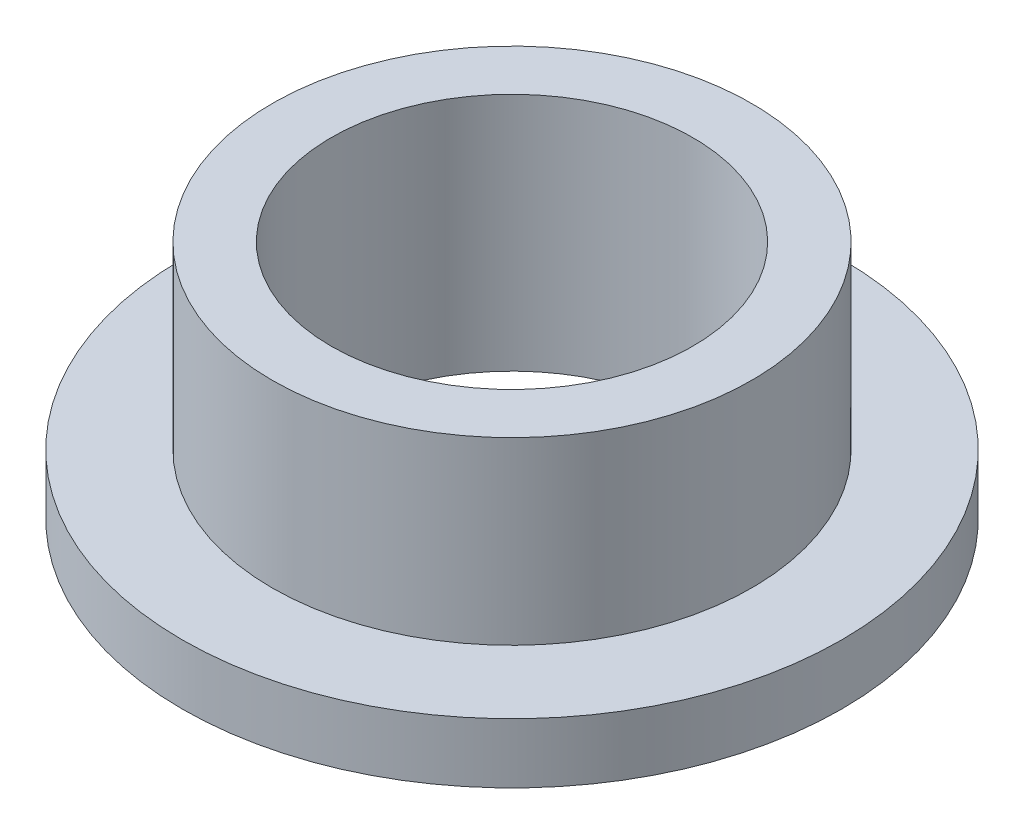
ISO-10303-21;
HEADER;
FILE_DESCRIPTION(('STEP AP214'),'2;1');
FILE_NAME('part.step','',(''),(''),'','','');
FILE_SCHEMA(('AUTOMOTIVE_DESIGN { 1 0 10303 214 1 1 1 1 }'));
ENDSEC;
DATA;
#1=APPLICATION_CONTEXT('core data for automotive mechanical design processes');
#2=APPLICATION_PROTOCOL_DEFINITION('international standard','automotive_design',2000,#1);
#3=PRODUCT_CONTEXT('',#1,'mechanical');
#4=PRODUCT('Part','Part','',(#3));
#5=PRODUCT_RELATED_PRODUCT_CATEGORY('part','',(#4));
#6=PRODUCT_DEFINITION_FORMATION('','',#4);
#7=PRODUCT_DEFINITION_CONTEXT('part definition',#1,'design');
#8=PRODUCT_DEFINITION('design','',#6,#7);
#9=PRODUCT_DEFINITION_SHAPE('','',#8);
#10=(LENGTH_UNIT() NAMED_UNIT(*) SI_UNIT(.MILLI.,.METRE.));
#11=(NAMED_UNIT(*) PLANE_ANGLE_UNIT() SI_UNIT($,.RADIAN.));
#12=(NAMED_UNIT(*) SI_UNIT($,.STERADIAN.) SOLID_ANGLE_UNIT());
#13=UNCERTAINTY_MEASURE_WITH_UNIT(LENGTH_MEASURE(1.E-05),#10,'distance_accuracy_value','');
#14=(GEOMETRIC_REPRESENTATION_CONTEXT(3) GLOBAL_UNCERTAINTY_ASSIGNED_CONTEXT((#13)) GLOBAL_UNIT_ASSIGNED_CONTEXT((#10,
#11,#12)) REPRESENTATION_CONTEXT('',''));
#15=CARTESIAN_POINT('',(0.,0.,0.));
#16=DIRECTION('',(0.,0.,1.));
#17=DIRECTION('',(1.,0.,0.));
#18=AXIS2_PLACEMENT_3D('',#15,#16,#17);
#19=CARTESIAN_POINT('',(0.,6.35,0.));
#20=DIRECTION('',(0.,1.,0.));
#21=DIRECTION('',(0.,0.,1.));
#22=AXIS2_PLACEMENT_3D('',#19,#20,#21);
#23=PLANE('',#22);
#24=CARTESIAN_POINT('',(0.,6.35,0.));
#25=DIRECTION('',(0.,1.,0.));
#26=DIRECTION('',(0.,0.,1.));
#27=AXIS2_PLACEMENT_3D('',#24,#25,#26);
#28=CIRCLE('',#27,6.35);
#29=CARTESIAN_POINT('',(0.,6.35,6.35));
#30=VERTEX_POINT('',#29);
#31=EDGE_CURVE('E10',#30,#30,#28,.T.);
#32=ORIENTED_EDGE('',*,*,#31,.T.);
#33=EDGE_LOOP('',(#32));
#34=FACE_BOUND('',#33,.T.);
#35=CARTESIAN_POINT('',(0.,6.35,0.));
#36=DIRECTION('',(0.,1.,0.));
#37=DIRECTION('',(0.,0.,1.));
#38=AXIS2_PLACEMENT_3D('',#35,#36,#37);
#39=CIRCLE('',#38,4.7879);
#40=CARTESIAN_POINT('',(0.,6.35,4.7879));
#41=VERTEX_POINT('',#40);
#42=EDGE_CURVE('E38',#41,#41,#39,.T.);
#43=ORIENTED_EDGE('',*,*,#42,.F.);
#44=EDGE_LOOP('',(#43));
#45=FACE_BOUND('',#44,.T.);
#46=ADVANCED_FACE('F31',(#34,#45),#23,.T.);
#47=CARTESIAN_POINT('',(0.,0.,0.));
#48=DIRECTION('',(0.,1.,0.));
#49=DIRECTION('',(0.,0.,1.));
#50=AXIS2_PLACEMENT_3D('',#47,#48,#49);
#51=PLANE('',#50);
#52=CARTESIAN_POINT('',(0.,0.,0.));
#53=DIRECTION('',(0.,1.,0.));
#54=DIRECTION('',(0.,0.,1.));
#55=AXIS2_PLACEMENT_3D('',#52,#53,#54);
#56=CIRCLE('',#55,4.7879);
#57=CARTESIAN_POINT('',(0.,0.,4.7879));
#58=VERTEX_POINT('',#57);
#59=EDGE_CURVE('E42',#58,#58,#56,.T.);
#60=ORIENTED_EDGE('',*,*,#59,.T.);
#61=EDGE_LOOP('',(#60));
#62=FACE_BOUND('',#61,.T.);
#63=CARTESIAN_POINT('',(0.,0.,0.));
#64=DIRECTION('',(0.,1.,0.));
#65=DIRECTION('',(0.,0.,1.));
#66=AXIS2_PLACEMENT_3D('',#63,#64,#65);
#67=CIRCLE('',#66,8.73125);
#68=CARTESIAN_POINT('',(0.,0.,8.73125));
#69=VERTEX_POINT('',#68);
#70=EDGE_CURVE('E49',#69,#69,#67,.T.);
#71=ORIENTED_EDGE('',*,*,#70,.F.);
#72=EDGE_LOOP('',(#71));
#73=FACE_BOUND('',#72,.T.);
#74=ADVANCED_FACE('F74',(#62,#73),#51,.F.);
#75=CARTESIAN_POINT('',(0.,6.35,0.));
#76=DIRECTION('',(0.,-1.,0.));
#77=DIRECTION('',(0.,0.,-1.));
#78=AXIS2_PLACEMENT_3D('',#75,#76,#77);
#79=CYLINDRICAL_SURFACE('',#78,6.35);
#80=CARTESIAN_POINT('',(0.,1.5875,0.));
#81=DIRECTION('',(0.,1.,0.));
#82=DIRECTION('',(0.,0.,1.));
#83=AXIS2_PLACEMENT_3D('',#80,#81,#82);
#84=CIRCLE('',#83,6.35);
#85=CARTESIAN_POINT('',(0.,1.5875,6.35));
#86=VERTEX_POINT('',#85);
#87=EDGE_CURVE('E52',#86,#86,#84,.T.);
#88=ORIENTED_EDGE('',*,*,#87,.T.);
#89=EDGE_LOOP('',(#88));
#90=FACE_BOUND('',#89,.T.);
#91=ORIENTED_EDGE('',*,*,#31,.F.);
#92=EDGE_LOOP('',(#91));
#93=FACE_BOUND('',#92,.T.);
#94=ADVANCED_FACE('F33',(#90,#93),#79,.T.);
#95=CARTESIAN_POINT('',(0.,6.35,0.));
#96=DIRECTION('',(0.,-1.,0.));
#97=DIRECTION('',(0.,0.,-1.));
#98=AXIS2_PLACEMENT_3D('',#95,#96,#97);
#99=CYLINDRICAL_SURFACE('',#98,4.7879);
#100=ORIENTED_EDGE('',*,*,#42,.T.);
#101=EDGE_LOOP('',(#100));
#102=FACE_BOUND('',#101,.T.);
#103=ORIENTED_EDGE('',*,*,#59,.F.);
#104=EDGE_LOOP('',(#103));
#105=FACE_BOUND('',#104,.T.);
#106=ADVANCED_FACE('F63',(#102,#105),#99,.F.);
#107=CARTESIAN_POINT('',(0.,1.5875,0.));
#108=DIRECTION('',(0.,1.,0.));
#109=DIRECTION('',(0.,0.,1.));
#110=AXIS2_PLACEMENT_3D('',#107,#108,#109);
#111=PLANE('',#110);
#112=CARTESIAN_POINT('',(0.,1.5875,0.));
#113=DIRECTION('',(0.,1.,0.));
#114=DIRECTION('',(0.,0.,1.));
#115=AXIS2_PLACEMENT_3D('',#112,#113,#114);
#116=CIRCLE('',#115,8.73125);
#117=CARTESIAN_POINT('',(0.,1.5875,8.73125));
#118=VERTEX_POINT('',#117);
#119=EDGE_CURVE('E47',#118,#118,#116,.T.);
#120=ORIENTED_EDGE('',*,*,#119,.T.);
#121=EDGE_LOOP('',(#120));
#122=FACE_BOUND('',#121,.T.);
#123=ORIENTED_EDGE('',*,*,#87,.F.);
#124=EDGE_LOOP('',(#123));
#125=FACE_BOUND('',#124,.T.);
#126=ADVANCED_FACE('F60',(#122,#125),#111,.T.);
#127=CARTESIAN_POINT('',(0.,1.5875,0.));
#128=DIRECTION('',(0.,-1.,0.));
#129=DIRECTION('',(0.,0.,-1.));
#130=AXIS2_PLACEMENT_3D('',#127,#128,#129);
#131=CYLINDRICAL_SURFACE('',#130,8.73125);
#132=ORIENTED_EDGE('',*,*,#119,.F.);
#133=EDGE_LOOP('',(#132));
#134=FACE_BOUND('',#133,.T.);
#135=ORIENTED_EDGE('',*,*,#70,.T.);
#136=EDGE_LOOP('',(#135));
#137=FACE_BOUND('',#136,.T.);
#138=ADVANCED_FACE('F62',(#134,#137),#131,.T.);
#139=CLOSED_SHELL('',(#46,#74,#94,#106,#126,#138));
#140=MANIFOLD_SOLID_BREP('B2',#139);
#141=ADVANCED_BREP_SHAPE_REPRESENTATION('',(#18,#140),#14);
#142=SHAPE_DEFINITION_REPRESENTATION(#9,#141);
ENDSEC;
END-ISO-10303-21;
